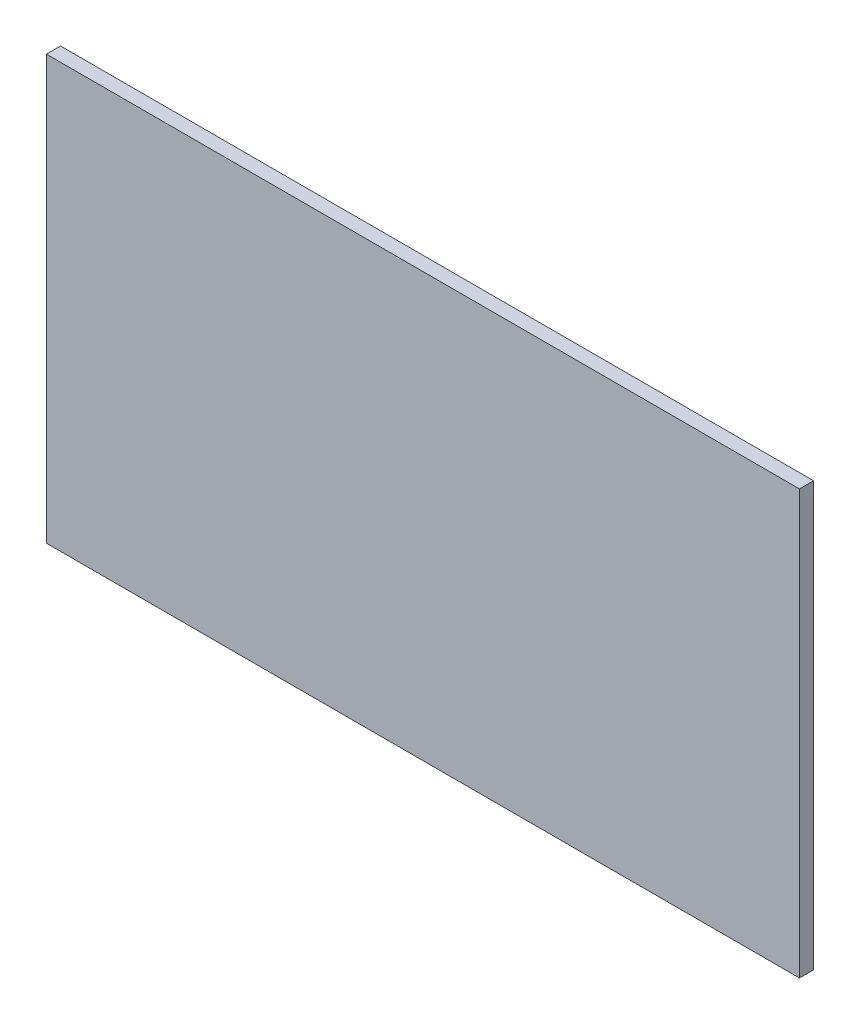
ISO-10303-21;
HEADER;
FILE_DESCRIPTION(('STEP AP214'),'2;1');
FILE_NAME('part.step','',(''),(''),'','','');
FILE_SCHEMA(('AUTOMOTIVE_DESIGN { 1 0 10303 214 1 1 1 1 }'));
ENDSEC;
DATA;
#1=APPLICATION_CONTEXT('core data for automotive mechanical design processes');
#2=APPLICATION_PROTOCOL_DEFINITION('international standard','automotive_design',2000,#1);
#3=PRODUCT_CONTEXT('',#1,'mechanical');
#4=PRODUCT('Part','Part','',(#3));
#5=PRODUCT_RELATED_PRODUCT_CATEGORY('part','',(#4));
#6=PRODUCT_DEFINITION_FORMATION('','',#4);
#7=PRODUCT_DEFINITION_CONTEXT('part definition',#1,'design');
#8=PRODUCT_DEFINITION('design','',#6,#7);
#9=PRODUCT_DEFINITION_SHAPE('','',#8);
#10=(LENGTH_UNIT() NAMED_UNIT(*) SI_UNIT(.MILLI.,.METRE.));
#11=(NAMED_UNIT(*) PLANE_ANGLE_UNIT() SI_UNIT($,.RADIAN.));
#12=(NAMED_UNIT(*) SI_UNIT($,.STERADIAN.) SOLID_ANGLE_UNIT());
#13=UNCERTAINTY_MEASURE_WITH_UNIT(LENGTH_MEASURE(1.E-05),#10,'distance_accuracy_value','');
#14=(GEOMETRIC_REPRESENTATION_CONTEXT(3) GLOBAL_UNCERTAINTY_ASSIGNED_CONTEXT((#13)) GLOBAL_UNIT_ASSIGNED_CONTEXT((#10,
#11,#12)) REPRESENTATION_CONTEXT('',''));
#15=CARTESIAN_POINT('',(0.,0.,0.));
#16=DIRECTION('',(0.,0.,1.));
#17=DIRECTION('',(1.,0.,0.));
#18=AXIS2_PLACEMENT_3D('',#15,#16,#17);
#19=CARTESIAN_POINT('',(508.,0.,225.425));
#20=DIRECTION('',(1.,0.,0.));
#21=DIRECTION('',(0.,0.,-1.));
#22=AXIS2_PLACEMENT_3D('',#19,#20,#21);
#23=PLANE('',#22);
#24=DIRECTION('',(0.,1.,0.));
#25=VECTOR('',#24,1.);
#26=CARTESIAN_POINT('',(508.,0.,244.475));
#27=LINE('',#26,#25);
#28=CARTESIAN_POINT('',(508.,0.,244.475));
#29=VERTEX_POINT('',#28);
#30=CARTESIAN_POINT('',(508.,571.5,244.475));
#31=VERTEX_POINT('',#30);
#32=EDGE_CURVE('E100',#29,#31,#27,.T.);
#33=ORIENTED_EDGE('',*,*,#32,.F.);
#34=DIRECTION('',(0.,0.,1.));
#35=VECTOR('',#34,1.);
#36=CARTESIAN_POINT('',(508.,0.,225.425));
#37=LINE('',#36,#35);
#38=CARTESIAN_POINT('',(508.,0.,225.425));
#39=VERTEX_POINT('',#38);
#40=EDGE_CURVE('E11',#39,#29,#37,.T.);
#41=ORIENTED_EDGE('',*,*,#40,.F.);
#42=DIRECTION('',(0.,1.,0.));
#43=VECTOR('',#42,1.);
#44=CARTESIAN_POINT('',(508.,0.,225.425));
#45=LINE('',#44,#43);
#46=CARTESIAN_POINT('',(508.,571.5,225.425));
#47=VERTEX_POINT('',#46);
#48=EDGE_CURVE('E94',#39,#47,#45,.T.);
#49=ORIENTED_EDGE('',*,*,#48,.T.);
#50=DIRECTION('',(0.,0.,1.));
#51=VECTOR('',#50,1.);
#52=CARTESIAN_POINT('',(508.,571.5,225.425));
#53=LINE('',#52,#51);
#54=EDGE_CURVE('E39',#47,#31,#53,.T.);
#55=ORIENTED_EDGE('',*,*,#54,.T.);
#56=EDGE_LOOP('',(#33,#41,#49,#55));
#57=FACE_BOUND('',#56,.T.);
#58=ADVANCED_FACE('F36',(#57),#23,.T.);
#59=CARTESIAN_POINT('',(508.,0.,225.425));
#60=DIRECTION('',(0.,-1.,0.));
#61=DIRECTION('',(0.,0.,-1.));
#62=AXIS2_PLACEMENT_3D('',#59,#60,#61);
#63=PLANE('',#62);
#64=DIRECTION('',(1.,0.,0.));
#65=VECTOR('',#64,1.);
#66=CARTESIAN_POINT('',(508.,0.,244.475));
#67=LINE('',#66,#65);
#68=CARTESIAN_POINT('',(-508.,0.,244.475));
#69=VERTEX_POINT('',#68);
#70=EDGE_CURVE('E96',#69,#29,#67,.T.);
#71=ORIENTED_EDGE('',*,*,#70,.F.);
#72=DIRECTION('',(0.,0.,1.));
#73=VECTOR('',#72,1.);
#74=CARTESIAN_POINT('',(-508.,0.,225.425));
#75=LINE('',#74,#73);
#76=CARTESIAN_POINT('',(-508.,0.,225.425));
#77=VERTEX_POINT('',#76);
#78=EDGE_CURVE('E45',#77,#69,#75,.T.);
#79=ORIENTED_EDGE('',*,*,#78,.F.);
#80=DIRECTION('',(1.,0.,0.));
#81=VECTOR('',#80,1.);
#82=CARTESIAN_POINT('',(508.,0.,225.425));
#83=LINE('',#82,#81);
#84=EDGE_CURVE('E91',#77,#39,#83,.T.);
#85=ORIENTED_EDGE('',*,*,#84,.T.);
#86=ORIENTED_EDGE('',*,*,#40,.T.);
#87=EDGE_LOOP('',(#71,#79,#85,#86));
#88=FACE_BOUND('',#87,.T.);
#89=ADVANCED_FACE('F110',(#88),#63,.T.);
#90=CARTESIAN_POINT('',(-508.,0.,225.425));
#91=DIRECTION('',(-1.,0.,0.));
#92=DIRECTION('',(0.,0.,1.));
#93=AXIS2_PLACEMENT_3D('',#90,#91,#92);
#94=PLANE('',#93);
#95=DIRECTION('',(0.,-1.,0.));
#96=VECTOR('',#95,1.);
#97=CARTESIAN_POINT('',(-508.,0.,244.475));
#98=LINE('',#97,#96);
#99=CARTESIAN_POINT('',(-508.,571.5,244.475));
#100=VERTEX_POINT('',#99);
#101=EDGE_CURVE('E86',#100,#69,#98,.T.);
#102=ORIENTED_EDGE('',*,*,#101,.F.);
#103=DIRECTION('',(0.,0.,1.));
#104=VECTOR('',#103,1.);
#105=CARTESIAN_POINT('',(-508.,571.5,225.425));
#106=LINE('',#105,#104);
#107=CARTESIAN_POINT('',(-508.,571.5,225.425));
#108=VERTEX_POINT('',#107);
#109=EDGE_CURVE('E81',#108,#100,#106,.T.);
#110=ORIENTED_EDGE('',*,*,#109,.F.);
#111=DIRECTION('',(0.,-1.,0.));
#112=VECTOR('',#111,1.);
#113=CARTESIAN_POINT('',(-508.,0.,225.425));
#114=LINE('',#113,#112);
#115=EDGE_CURVE('E84',#108,#77,#114,.T.);
#116=ORIENTED_EDGE('',*,*,#115,.T.);
#117=ORIENTED_EDGE('',*,*,#78,.T.);
#118=EDGE_LOOP('',(#102,#110,#116,#117));
#119=FACE_BOUND('',#118,.T.);
#120=ADVANCED_FACE('F83',(#119),#94,.T.);
#121=CARTESIAN_POINT('',(508.,571.5,225.425));
#122=DIRECTION('',(0.,1.,0.));
#123=DIRECTION('',(-1.,0.,0.));
#124=AXIS2_PLACEMENT_3D('',#121,#122,#123);
#125=PLANE('',#124);
#126=DIRECTION('',(-1.,0.,0.));
#127=VECTOR('',#126,1.);
#128=CARTESIAN_POINT('',(508.,571.5,244.475));
#129=LINE('',#128,#127);
#130=EDGE_CURVE('E103',#31,#100,#129,.T.);
#131=ORIENTED_EDGE('',*,*,#130,.F.);
#132=ORIENTED_EDGE('',*,*,#54,.F.);
#133=DIRECTION('',(-1.,0.,0.));
#134=VECTOR('',#133,1.);
#135=CARTESIAN_POINT('',(508.,571.5,225.425));
#136=LINE('',#135,#134);
#137=EDGE_CURVE('E90',#47,#108,#136,.T.);
#138=ORIENTED_EDGE('',*,*,#137,.T.);
#139=ORIENTED_EDGE('',*,*,#109,.T.);
#140=EDGE_LOOP('',(#131,#132,#138,#139));
#141=FACE_BOUND('',#140,.T.);
#142=ADVANCED_FACE('F93',(#141),#125,.T.);
#143=CARTESIAN_POINT('',(0.,0.,225.425));
#144=DIRECTION('',(0.,0.,1.));
#145=DIRECTION('',(1.,0.,0.));
#146=AXIS2_PLACEMENT_3D('',#143,#144,#145);
#147=PLANE('',#146);
#148=ORIENTED_EDGE('',*,*,#48,.F.);
#149=ORIENTED_EDGE('',*,*,#84,.F.);
#150=ORIENTED_EDGE('',*,*,#115,.F.);
#151=ORIENTED_EDGE('',*,*,#137,.F.);
#152=EDGE_LOOP('',(#148,#149,#150,#151));
#153=FACE_BOUND('',#152,.T.);
#154=ADVANCED_FACE('F89',(#153),#147,.F.);
#155=CARTESIAN_POINT('',(0.,0.,244.475));
#156=DIRECTION('',(0.,0.,1.));
#157=DIRECTION('',(1.,0.,0.));
#158=AXIS2_PLACEMENT_3D('',#155,#156,#157);
#159=PLANE('',#158);
#160=ORIENTED_EDGE('',*,*,#32,.T.);
#161=ORIENTED_EDGE('',*,*,#130,.T.);
#162=ORIENTED_EDGE('',*,*,#101,.T.);
#163=ORIENTED_EDGE('',*,*,#70,.T.);
#164=EDGE_LOOP('',(#160,#161,#162,#163));
#165=FACE_BOUND('',#164,.T.);
#166=ADVANCED_FACE('F109',(#165),#159,.T.);
#167=CLOSED_SHELL('',(#58,#89,#120,#142,#154,#166));
#168=MANIFOLD_SOLID_BREP('B2',#167);
#169=ADVANCED_BREP_SHAPE_REPRESENTATION('',(#18,#168),#14);
#170=SHAPE_DEFINITION_REPRESENTATION(#9,#169);
ENDSEC;
END-ISO-10303-21;
